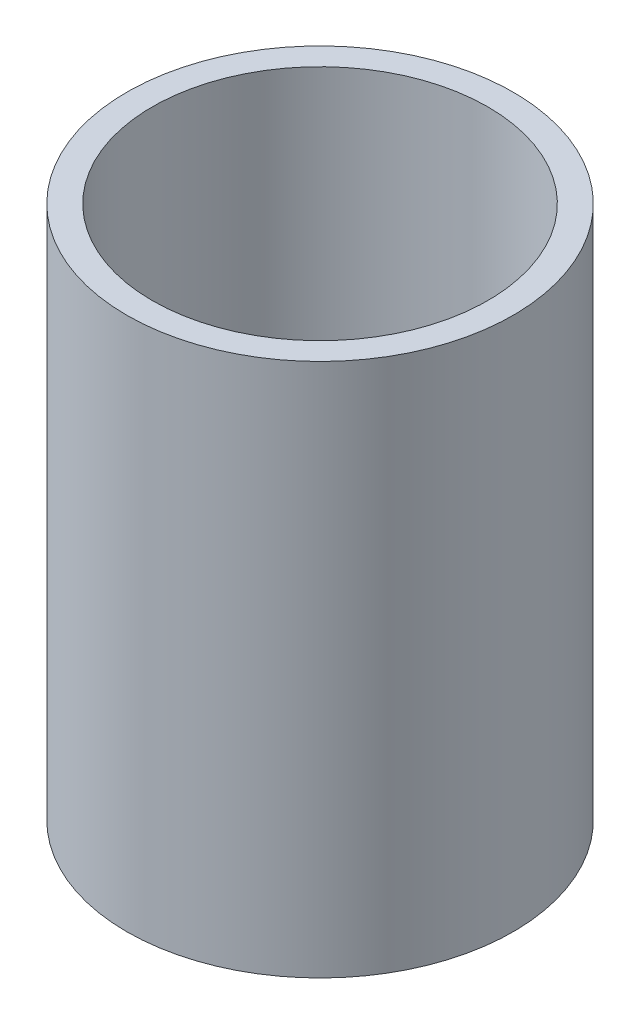
ISO-10303-21;
HEADER;
FILE_DESCRIPTION(('STEP AP214'),'2;1');
FILE_NAME('part.step','',(''),(''),'','','');
FILE_SCHEMA(('AUTOMOTIVE_DESIGN { 1 0 10303 214 1 1 1 1 }'));
ENDSEC;
DATA;
#1=APPLICATION_CONTEXT('core data for automotive mechanical design processes');
#2=APPLICATION_PROTOCOL_DEFINITION('international standard','automotive_design',2000,#1);
#3=PRODUCT_CONTEXT('',#1,'mechanical');
#4=PRODUCT('Part','Part','',(#3));
#5=PRODUCT_RELATED_PRODUCT_CATEGORY('part','',(#4));
#6=PRODUCT_DEFINITION_FORMATION('','',#4);
#7=PRODUCT_DEFINITION_CONTEXT('part definition',#1,'design');
#8=PRODUCT_DEFINITION('design','',#6,#7);
#9=PRODUCT_DEFINITION_SHAPE('','',#8);
#10=(LENGTH_UNIT() NAMED_UNIT(*) SI_UNIT(.MILLI.,.METRE.));
#11=(NAMED_UNIT(*) PLANE_ANGLE_UNIT() SI_UNIT($,.RADIAN.));
#12=(NAMED_UNIT(*) SI_UNIT($,.STERADIAN.) SOLID_ANGLE_UNIT());
#13=UNCERTAINTY_MEASURE_WITH_UNIT(LENGTH_MEASURE(1.E-05),#10,'distance_accuracy_value','');
#14=(GEOMETRIC_REPRESENTATION_CONTEXT(3) GLOBAL_UNCERTAINTY_ASSIGNED_CONTEXT((#13)) GLOBAL_UNIT_ASSIGNED_CONTEXT((#10,
#11,#12)) REPRESENTATION_CONTEXT('',''));
#15=CARTESIAN_POINT('',(0.,0.,0.));
#16=DIRECTION('',(0.,0.,1.));
#17=DIRECTION('',(1.,0.,0.));
#18=AXIS2_PLACEMENT_3D('',#15,#16,#17);
#19=CARTESIAN_POINT('',(0.,55.,0.));
#20=DIRECTION('',(0.,1.,0.));
#21=DIRECTION('',(0.,0.,1.));
#22=AXIS2_PLACEMENT_3D('',#19,#20,#21);
#23=CYLINDRICAL_SURFACE('',#22,48.26);
#24=CARTESIAN_POINT('',(0.,-87.732365567385,0.));
#25=DIRECTION('',(0.,1.,0.));
#26=DIRECTION('',(0.,0.,1.));
#27=AXIS2_PLACEMENT_3D('',#24,#25,#26);
#28=CIRCLE('',#27,48.26);
#29=CARTESIAN_POINT('',(0.,-87.732365567385,48.26));
#30=VERTEX_POINT('',#29);
#31=EDGE_CURVE('E10',#30,#30,#28,.T.);
#32=ORIENTED_EDGE('',*,*,#31,.T.);
#33=EDGE_LOOP('',(#32));
#34=FACE_BOUND('',#33,.T.);
#35=CARTESIAN_POINT('',(0.,45.6176344326149,0.));
#36=DIRECTION('',(0.,1.,0.));
#37=DIRECTION('',(0.,0.,1.));
#38=AXIS2_PLACEMENT_3D('',#35,#36,#37);
#39=CIRCLE('',#38,48.26);
#40=CARTESIAN_POINT('',(0.,45.6176344326149,48.26));
#41=VERTEX_POINT('',#40);
#42=EDGE_CURVE('E45',#41,#41,#39,.T.);
#43=ORIENTED_EDGE('',*,*,#42,.F.);
#44=EDGE_LOOP('',(#43));
#45=FACE_BOUND('',#44,.T.);
#46=ADVANCED_FACE('F31',(#34,#45),#23,.T.);
#47=CARTESIAN_POINT('',(-48.26,-87.7323655673851,0.));
#48=DIRECTION('',(0.,-1.,0.));
#49=DIRECTION('',(0.,0.,-1.));
#50=AXIS2_PLACEMENT_3D('',#47,#48,#49);
#51=PLANE('',#50);
#52=CARTESIAN_POINT('',(0.,-87.732365567385,0.));
#53=DIRECTION('',(0.,1.,0.));
#54=DIRECTION('',(0.,0.,1.));
#55=AXIS2_PLACEMENT_3D('',#52,#53,#54);
#56=CIRCLE('',#55,41.91);
#57=CARTESIAN_POINT('',(0.,-87.732365567385,41.91));
#58=VERTEX_POINT('',#57);
#59=EDGE_CURVE('E37',#58,#58,#56,.T.);
#60=ORIENTED_EDGE('',*,*,#59,.T.);
#61=EDGE_LOOP('',(#60));
#62=FACE_BOUND('',#61,.T.);
#63=ORIENTED_EDGE('',*,*,#31,.F.);
#64=EDGE_LOOP('',(#63));
#65=FACE_BOUND('',#64,.T.);
#66=ADVANCED_FACE('F55',(#62,#65),#51,.T.);
#67=CARTESIAN_POINT('',(0.,55.,0.));
#68=DIRECTION('',(0.,1.,0.));
#69=DIRECTION('',(0.,0.,1.));
#70=AXIS2_PLACEMENT_3D('',#67,#68,#69);
#71=CYLINDRICAL_SURFACE('',#70,41.91);
#72=CARTESIAN_POINT('',(0.,45.6176344326149,0.));
#73=DIRECTION('',(0.,1.,0.));
#74=DIRECTION('',(0.,0.,1.));
#75=AXIS2_PLACEMENT_3D('',#72,#73,#74);
#76=CIRCLE('',#75,41.91);
#77=CARTESIAN_POINT('',(0.,45.6176344326149,41.91));
#78=VERTEX_POINT('',#77);
#79=EDGE_CURVE('E41',#78,#78,#76,.T.);
#80=ORIENTED_EDGE('',*,*,#79,.T.);
#81=EDGE_LOOP('',(#80));
#82=FACE_BOUND('',#81,.T.);
#83=ORIENTED_EDGE('',*,*,#59,.F.);
#84=EDGE_LOOP('',(#83));
#85=FACE_BOUND('',#84,.T.);
#86=ADVANCED_FACE('F59',(#82,#85),#71,.F.);
#87=CARTESIAN_POINT('',(-48.26,45.6176344326149,0.));
#88=DIRECTION('',(0.,1.,0.));
#89=DIRECTION('',(0.,0.,1.));
#90=AXIS2_PLACEMENT_3D('',#87,#88,#89);
#91=PLANE('',#90);
#92=ORIENTED_EDGE('',*,*,#42,.T.);
#93=EDGE_LOOP('',(#92));
#94=FACE_BOUND('',#93,.T.);
#95=ORIENTED_EDGE('',*,*,#79,.F.);
#96=EDGE_LOOP('',(#95));
#97=FACE_BOUND('',#96,.T.);
#98=ADVANCED_FACE('F51',(#94,#97),#91,.T.);
#99=CLOSED_SHELL('',(#46,#66,#86,#98));
#100=MANIFOLD_SOLID_BREP('B2',#99);
#101=ADVANCED_BREP_SHAPE_REPRESENTATION('',(#18,#100),#14);
#102=SHAPE_DEFINITION_REPRESENTATION(#9,#101);
ENDSEC;
END-ISO-10303-21;
